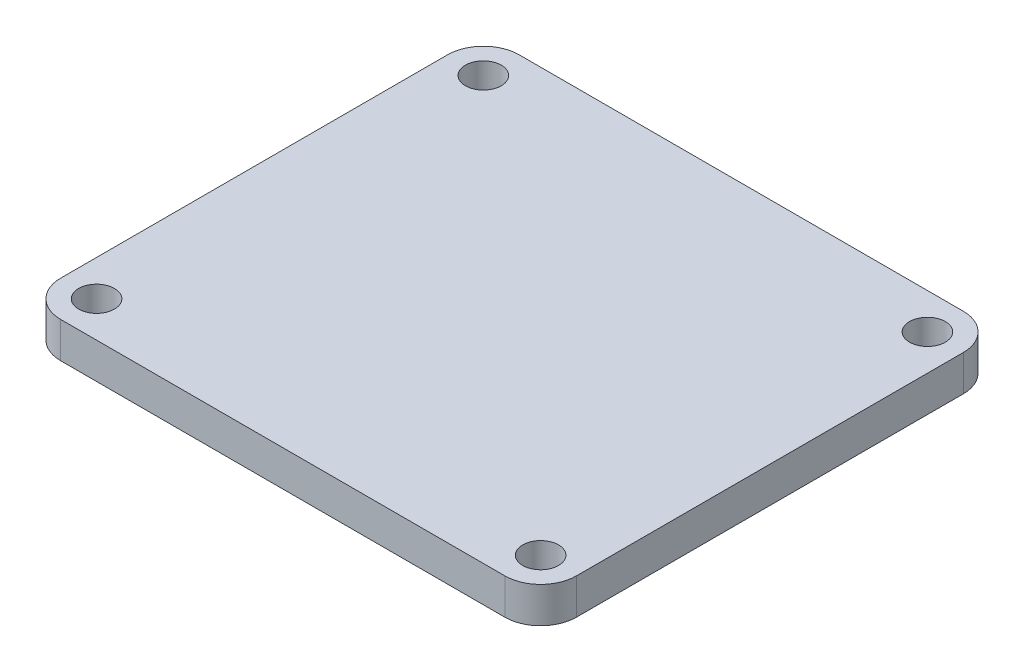
ISO-10303-21;
HEADER;
FILE_DESCRIPTION(('STEP AP214'),'2;1');
FILE_NAME('part.step','',(''),(''),'','','');
FILE_SCHEMA(('AUTOMOTIVE_DESIGN { 1 0 10303 214 1 1 1 1 }'));
ENDSEC;
DATA;
#1=APPLICATION_CONTEXT('core data for automotive mechanical design processes');
#2=APPLICATION_PROTOCOL_DEFINITION('international standard','automotive_design',2000,#1);
#3=PRODUCT_CONTEXT('',#1,'mechanical');
#4=PRODUCT('Part','Part','',(#3));
#5=PRODUCT_RELATED_PRODUCT_CATEGORY('part','',(#4));
#6=PRODUCT_DEFINITION_FORMATION('','',#4);
#7=PRODUCT_DEFINITION_CONTEXT('part definition',#1,'design');
#8=PRODUCT_DEFINITION('design','',#6,#7);
#9=PRODUCT_DEFINITION_SHAPE('','',#8);
#10=(LENGTH_UNIT() NAMED_UNIT(*) SI_UNIT(.MILLI.,.METRE.));
#11=(NAMED_UNIT(*) PLANE_ANGLE_UNIT() SI_UNIT($,.RADIAN.));
#12=(NAMED_UNIT(*) SI_UNIT($,.STERADIAN.) SOLID_ANGLE_UNIT());
#13=UNCERTAINTY_MEASURE_WITH_UNIT(LENGTH_MEASURE(1.E-05),#10,'distance_accuracy_value','');
#14=(GEOMETRIC_REPRESENTATION_CONTEXT(3) GLOBAL_UNCERTAINTY_ASSIGNED_CONTEXT((#13)) GLOBAL_UNIT_ASSIGNED_CONTEXT((#10,
#11,#12)) REPRESENTATION_CONTEXT('',''));
#15=CARTESIAN_POINT('',(0.,0.,0.));
#16=DIRECTION('',(0.,0.,1.));
#17=DIRECTION('',(1.,0.,0.));
#18=AXIS2_PLACEMENT_3D('',#15,#16,#17);
#19=CARTESIAN_POINT('',(-32.0842105263158,5.,0.));
#20=DIRECTION('',(1.,0.,0.));
#21=DIRECTION('',(0.,0.,-1.));
#22=AXIS2_PLACEMENT_3D('',#19,#20,#21);
#23=PLANE('',#22);
#24=DIRECTION('',(0.,0.,1.));
#25=VECTOR('',#24,1.);
#26=CARTESIAN_POINT('',(-32.0842105263158,0.,0.));
#27=LINE('',#26,#25);
#28=CARTESIAN_POINT('',(-32.0842105263158,0.,-12.5578947368421));
#29=VERTEX_POINT('',#28);
#30=CARTESIAN_POINT('',(-32.0842105263158,0.,41.4421052631579));
#31=VERTEX_POINT('',#30);
#32=EDGE_CURVE('E129',#29,#31,#27,.T.);
#33=ORIENTED_EDGE('',*,*,#32,.T.);
#34=DIRECTION('',(0.,-1.,0.));
#35=VECTOR('',#34,1.);
#36=CARTESIAN_POINT('',(-32.0842105263158,5.,41.4421052631579));
#37=LINE('',#36,#35);
#38=CARTESIAN_POINT('',(-32.0842105263158,5.,41.4421052631579));
#39=VERTEX_POINT('',#38);
#40=EDGE_CURVE('E106',#31,#39,#37,.F.);
#41=ORIENTED_EDGE('',*,*,#40,.T.);
#42=DIRECTION('',(0.,0.,1.));
#43=VECTOR('',#42,1.);
#44=CARTESIAN_POINT('',(-32.0842105263158,5.,0.));
#45=LINE('',#44,#43);
#46=CARTESIAN_POINT('',(-32.0842105263158,5.,-12.5578947368421));
#47=VERTEX_POINT('',#46);
#48=EDGE_CURVE('E242',#47,#39,#45,.T.);
#49=ORIENTED_EDGE('',*,*,#48,.F.);
#50=DIRECTION('',(0.,-1.,0.));
#51=VECTOR('',#50,1.);
#52=CARTESIAN_POINT('',(-32.0842105263158,0.,-12.5578947368421));
#53=LINE('',#52,#51);
#54=EDGE_CURVE('E111',#47,#29,#53,.T.);
#55=ORIENTED_EDGE('',*,*,#54,.T.);
#56=EDGE_LOOP('',(#33,#41,#49,#55));
#57=FACE_BOUND('',#56,.T.);
#58=ADVANCED_FACE('F35',(#57),#23,.F.);
#59=CARTESIAN_POINT('',(0.,5.,46.4421052631579));
#60=DIRECTION('',(0.,0.,-1.));
#61=DIRECTION('',(-1.,0.,0.));
#62=AXIS2_PLACEMENT_3D('',#59,#60,#61);
#63=PLANE('',#62);
#64=DIRECTION('',(1.,0.,0.));
#65=VECTOR('',#64,1.);
#66=CARTESIAN_POINT('',(0.,5.,46.4421052631579));
#67=LINE('',#66,#65);
#68=CARTESIAN_POINT('',(-27.0842105263158,5.,46.4421052631579));
#69=VERTEX_POINT('',#68);
#70=CARTESIAN_POINT('',(34.9157894736842,5.,46.4421052631579));
#71=VERTEX_POINT('',#70);
#72=EDGE_CURVE('E121',#69,#71,#67,.T.);
#73=ORIENTED_EDGE('',*,*,#72,.F.);
#74=DIRECTION('',(0.,-1.,0.));
#75=VECTOR('',#74,1.);
#76=CARTESIAN_POINT('',(-27.0842105263158,5.,46.4421052631579));
#77=LINE('',#76,#75);
#78=CARTESIAN_POINT('',(-27.0842105263158,0.,46.4421052631579));
#79=VERTEX_POINT('',#78);
#80=EDGE_CURVE('E105',#69,#79,#77,.T.);
#81=ORIENTED_EDGE('',*,*,#80,.T.);
#82=DIRECTION('',(1.,0.,0.));
#83=VECTOR('',#82,1.);
#84=CARTESIAN_POINT('',(0.,0.,46.4421052631579));
#85=LINE('',#84,#83);
#86=CARTESIAN_POINT('',(34.9157894736842,0.,46.4421052631579));
#87=VERTEX_POINT('',#86);
#88=EDGE_CURVE('E118',#79,#87,#85,.T.);
#89=ORIENTED_EDGE('',*,*,#88,.T.);
#90=DIRECTION('',(0.,-1.,0.));
#91=VECTOR('',#90,1.);
#92=CARTESIAN_POINT('',(34.9157894736842,5.,46.4421052631579));
#93=LINE('',#92,#91);
#94=EDGE_CURVE('E123',#87,#71,#93,.F.);
#95=ORIENTED_EDGE('',*,*,#94,.T.);
#96=EDGE_LOOP('',(#73,#81,#89,#95));
#97=FACE_BOUND('',#96,.T.);
#98=ADVANCED_FACE('F117',(#97),#63,.F.);
#99=CARTESIAN_POINT('',(39.9157894736842,5.,0.));
#100=DIRECTION('',(1.,0.,0.));
#101=DIRECTION('',(0.,0.,-1.));
#102=AXIS2_PLACEMENT_3D('',#99,#100,#101);
#103=PLANE('',#102);
#104=DIRECTION('',(0.,0.,1.));
#105=VECTOR('',#104,1.);
#106=CARTESIAN_POINT('',(39.9157894736842,5.,0.));
#107=LINE('',#106,#105);
#108=CARTESIAN_POINT('',(39.9157894736842,5.,-12.5578947368421));
#109=VERTEX_POINT('',#108);
#110=CARTESIAN_POINT('',(39.9157894736842,5.,41.4421052631579));
#111=VERTEX_POINT('',#110);
#112=EDGE_CURVE('E175',#109,#111,#107,.T.);
#113=ORIENTED_EDGE('',*,*,#112,.T.);
#114=DIRECTION('',(0.,-1.,0.));
#115=VECTOR('',#114,1.);
#116=CARTESIAN_POINT('',(39.9157894736842,0.,41.4421052631579));
#117=LINE('',#116,#115);
#118=CARTESIAN_POINT('',(39.9157894736842,0.,41.4421052631579));
#119=VERTEX_POINT('',#118);
#120=EDGE_CURVE('E167',#111,#119,#117,.T.);
#121=ORIENTED_EDGE('',*,*,#120,.T.);
#122=DIRECTION('',(0.,0.,1.));
#123=VECTOR('',#122,1.);
#124=CARTESIAN_POINT('',(39.9157894736842,0.,0.));
#125=LINE('',#124,#123);
#126=CARTESIAN_POINT('',(39.9157894736842,0.,-12.5578947368421));
#127=VERTEX_POINT('',#126);
#128=EDGE_CURVE('E128',#127,#119,#125,.T.);
#129=ORIENTED_EDGE('',*,*,#128,.F.);
#130=DIRECTION('',(0.,-1.,0.));
#131=VECTOR('',#130,1.);
#132=CARTESIAN_POINT('',(39.9157894736842,5.,-12.5578947368421));
#133=LINE('',#132,#131);
#134=EDGE_CURVE('E165',#127,#109,#133,.F.);
#135=ORIENTED_EDGE('',*,*,#134,.T.);
#136=EDGE_LOOP('',(#113,#121,#129,#135));
#137=FACE_BOUND('',#136,.T.);
#138=ADVANCED_FACE('F173',(#137),#103,.T.);
#139=CARTESIAN_POINT('',(34.9157894736842,5.,-12.5578947368421));
#140=DIRECTION('',(0.,-1.,0.));
#141=DIRECTION('',(0.,0.,-1.));
#142=AXIS2_PLACEMENT_3D('',#139,#140,#141);
#143=CYLINDRICAL_SURFACE('',#142,2.5);
#144=CARTESIAN_POINT('',(34.9157894736842,5.,-12.5578947368421));
#145=DIRECTION('',(0.,1.,0.));
#146=DIRECTION('',(0.,0.,1.));
#147=AXIS2_PLACEMENT_3D('',#144,#145,#146);
#148=CIRCLE('',#147,2.5);
#149=CARTESIAN_POINT('',(34.9157894736842,5.,-10.0578947368421));
#150=VERTEX_POINT('',#149);
#151=EDGE_CURVE('E187',#150,#150,#148,.T.);
#152=ORIENTED_EDGE('',*,*,#151,.T.);
#153=EDGE_LOOP('',(#152));
#154=FACE_BOUND('',#153,.T.);
#155=CARTESIAN_POINT('',(34.9157894736842,0.,-12.5578947368421));
#156=DIRECTION('',(0.,1.,0.));
#157=DIRECTION('',(0.,0.,1.));
#158=AXIS2_PLACEMENT_3D('',#155,#156,#157);
#159=CIRCLE('',#158,2.5);
#160=CARTESIAN_POINT('',(34.9157894736842,0.,-10.0578947368421));
#161=VERTEX_POINT('',#160);
#162=EDGE_CURVE('E142',#161,#161,#159,.T.);
#163=ORIENTED_EDGE('',*,*,#162,.F.);
#164=EDGE_LOOP('',(#163));
#165=FACE_BOUND('',#164,.T.);
#166=ADVANCED_FACE('F224',(#154,#165),#143,.F.);
#167=CARTESIAN_POINT('',(-27.0842105263158,5.,-12.5578947368421));
#168=DIRECTION('',(0.,-1.,0.));
#169=DIRECTION('',(0.,0.,-1.));
#170=AXIS2_PLACEMENT_3D('',#167,#168,#169);
#171=CYLINDRICAL_SURFACE('',#170,2.5);
#172=CARTESIAN_POINT('',(-27.0842105263158,5.,-12.5578947368421));
#173=DIRECTION('',(0.,1.,0.));
#174=DIRECTION('',(0.,0.,1.));
#175=AXIS2_PLACEMENT_3D('',#172,#173,#174);
#176=CIRCLE('',#175,2.5);
#177=CARTESIAN_POINT('',(-27.0842105263158,5.,-10.0578947368421));
#178=VERTEX_POINT('',#177);
#179=EDGE_CURVE('E184',#178,#178,#176,.F.);
#180=ORIENTED_EDGE('',*,*,#179,.F.);
#181=EDGE_LOOP('',(#180));
#182=FACE_BOUND('',#181,.T.);
#183=CARTESIAN_POINT('',(-27.0842105263158,0.,-12.5578947368421));
#184=DIRECTION('',(0.,1.,0.));
#185=DIRECTION('',(0.,0.,1.));
#186=AXIS2_PLACEMENT_3D('',#183,#184,#185);
#187=CIRCLE('',#186,2.5);
#188=CARTESIAN_POINT('',(-27.0842105263158,0.,-10.0578947368421));
#189=VERTEX_POINT('',#188);
#190=EDGE_CURVE('E139',#189,#189,#187,.F.);
#191=ORIENTED_EDGE('',*,*,#190,.T.);
#192=EDGE_LOOP('',(#191));
#193=FACE_BOUND('',#192,.T.);
#194=ADVANCED_FACE('F211',(#182,#193),#171,.F.);
#195=CARTESIAN_POINT('',(0.,5.,-17.5578947368421));
#196=DIRECTION('',(0.,0.,-1.));
#197=DIRECTION('',(-1.,0.,0.));
#198=AXIS2_PLACEMENT_3D('',#195,#196,#197);
#199=PLANE('',#198);
#200=DIRECTION('',(1.,0.,0.));
#201=VECTOR('',#200,1.);
#202=CARTESIAN_POINT('',(0.,5.,-17.5578947368421));
#203=LINE('',#202,#201);
#204=CARTESIAN_POINT('',(-27.0842105263158,5.,-17.5578947368421));
#205=VERTEX_POINT('',#204);
#206=CARTESIAN_POINT('',(34.9157894736842,5.,-17.5578947368421));
#207=VERTEX_POINT('',#206);
#208=EDGE_CURVE('E182',#205,#207,#203,.T.);
#209=ORIENTED_EDGE('',*,*,#208,.T.);
#210=DIRECTION('',(0.,-1.,0.));
#211=VECTOR('',#210,1.);
#212=CARTESIAN_POINT('',(34.9157894736842,5.,-17.5578947368421));
#213=LINE('',#212,#211);
#214=CARTESIAN_POINT('',(34.9157894736842,0.,-17.5578947368421));
#215=VERTEX_POINT('',#214);
#216=EDGE_CURVE('E11',#207,#215,#213,.T.);
#217=ORIENTED_EDGE('',*,*,#216,.T.);
#218=DIRECTION('',(1.,0.,0.));
#219=VECTOR('',#218,1.);
#220=CARTESIAN_POINT('',(0.,0.,-17.5578947368421));
#221=LINE('',#220,#219);
#222=CARTESIAN_POINT('',(-27.0842105263158,0.,-17.5578947368421));
#223=VERTEX_POINT('',#222);
#224=EDGE_CURVE('E131',#223,#215,#221,.T.);
#225=ORIENTED_EDGE('',*,*,#224,.F.);
#226=DIRECTION('',(0.,-1.,0.));
#227=VECTOR('',#226,1.);
#228=CARTESIAN_POINT('',(-27.0842105263158,5.,-17.5578947368421));
#229=LINE('',#228,#227);
#230=EDGE_CURVE('E43',#223,#205,#229,.F.);
#231=ORIENTED_EDGE('',*,*,#230,.T.);
#232=EDGE_LOOP('',(#209,#217,#225,#231));
#233=FACE_BOUND('',#232,.T.);
#234=ADVANCED_FACE('F181',(#233),#199,.T.);
#235=CARTESIAN_POINT('',(-27.0842105263158,5.,41.4421052631579));
#236=DIRECTION('',(0.,-1.,0.));
#237=DIRECTION('',(0.,0.,-1.));
#238=AXIS2_PLACEMENT_3D('',#235,#236,#237);
#239=CYLINDRICAL_SURFACE('',#238,2.5);
#240=CARTESIAN_POINT('',(-27.0842105263158,5.,41.4421052631579));
#241=DIRECTION('',(0.,1.,0.));
#242=DIRECTION('',(0.,0.,1.));
#243=AXIS2_PLACEMENT_3D('',#240,#241,#242);
#244=CIRCLE('',#243,2.5);
#245=CARTESIAN_POINT('',(-27.0842105263158,5.,43.9421052631579));
#246=VERTEX_POINT('',#245);
#247=EDGE_CURVE('E148',#246,#246,#244,.T.);
#248=ORIENTED_EDGE('',*,*,#247,.T.);
#249=EDGE_LOOP('',(#248));
#250=FACE_BOUND('',#249,.T.);
#251=CARTESIAN_POINT('',(-27.0842105263158,0.,41.4421052631579));
#252=DIRECTION('',(0.,1.,0.));
#253=DIRECTION('',(0.,0.,1.));
#254=AXIS2_PLACEMENT_3D('',#251,#252,#253);
#255=CIRCLE('',#254,2.5);
#256=CARTESIAN_POINT('',(-27.0842105263158,0.,43.9421052631579));
#257=VERTEX_POINT('',#256);
#258=EDGE_CURVE('E133',#257,#257,#255,.T.);
#259=ORIENTED_EDGE('',*,*,#258,.F.);
#260=EDGE_LOOP('',(#259));
#261=FACE_BOUND('',#260,.T.);
#262=ADVANCED_FACE('F199',(#250,#261),#239,.F.);
#263=CARTESIAN_POINT('',(34.9157894736842,5.,41.4421052631579));
#264=DIRECTION('',(0.,-1.,0.));
#265=DIRECTION('',(0.,0.,-1.));
#266=AXIS2_PLACEMENT_3D('',#263,#264,#265);
#267=CYLINDRICAL_SURFACE('',#266,2.5);
#268=CARTESIAN_POINT('',(34.9157894736842,5.,41.4421052631579));
#269=DIRECTION('',(0.,1.,0.));
#270=DIRECTION('',(0.,0.,1.));
#271=AXIS2_PLACEMENT_3D('',#268,#269,#270);
#272=CIRCLE('',#271,2.5);
#273=CARTESIAN_POINT('',(34.9157894736842,5.,43.9421052631579));
#274=VERTEX_POINT('',#273);
#275=EDGE_CURVE('E149',#274,#274,#272,.F.);
#276=ORIENTED_EDGE('',*,*,#275,.F.);
#277=EDGE_LOOP('',(#276));
#278=FACE_BOUND('',#277,.T.);
#279=CARTESIAN_POINT('',(34.9157894736842,0.,41.4421052631579));
#280=DIRECTION('',(0.,1.,0.));
#281=DIRECTION('',(0.,0.,1.));
#282=AXIS2_PLACEMENT_3D('',#279,#280,#281);
#283=CIRCLE('',#282,2.5);
#284=CARTESIAN_POINT('',(34.9157894736842,0.,43.9421052631579));
#285=VERTEX_POINT('',#284);
#286=EDGE_CURVE('E145',#285,#285,#283,.F.);
#287=ORIENTED_EDGE('',*,*,#286,.T.);
#288=EDGE_LOOP('',(#287));
#289=FACE_BOUND('',#288,.T.);
#290=ADVANCED_FACE('F201',(#278,#289),#267,.F.);
#291=CARTESIAN_POINT('',(0.,5.,0.));
#292=DIRECTION('',(0.,1.,0.));
#293=DIRECTION('',(0.,0.,1.));
#294=AXIS2_PLACEMENT_3D('',#291,#292,#293);
#295=PLANE('',#294);
#296=ORIENTED_EDGE('',*,*,#247,.F.);
#297=EDGE_LOOP('',(#296));
#298=FACE_BOUND('',#297,.T.);
#299=ORIENTED_EDGE('',*,*,#48,.T.);
#300=CARTESIAN_POINT('',(-27.0842105263158,5.,41.4421052631579));
#301=DIRECTION('',(0.,1.,0.));
#302=DIRECTION('',(0.,0.,1.));
#303=AXIS2_PLACEMENT_3D('',#300,#301,#302);
#304=CIRCLE('',#303,5.);
#305=EDGE_CURVE('E163',#39,#69,#304,.T.);
#306=ORIENTED_EDGE('',*,*,#305,.T.);
#307=ORIENTED_EDGE('',*,*,#72,.T.);
#308=CARTESIAN_POINT('',(34.9157894736842,5.,41.4421052631579));
#309=DIRECTION('',(0.,1.,0.));
#310=DIRECTION('',(0.,0.,1.));
#311=AXIS2_PLACEMENT_3D('',#308,#309,#310);
#312=CIRCLE('',#311,5.);
#313=EDGE_CURVE('E161',#71,#111,#312,.T.);
#314=ORIENTED_EDGE('',*,*,#313,.T.);
#315=ORIENTED_EDGE('',*,*,#112,.F.);
#316=CARTESIAN_POINT('',(34.9157894736842,5.,-12.5578947368421));
#317=DIRECTION('',(0.,1.,0.));
#318=DIRECTION('',(0.,0.,1.));
#319=AXIS2_PLACEMENT_3D('',#316,#317,#318);
#320=CIRCLE('',#319,5.);
#321=EDGE_CURVE('E50',#109,#207,#320,.T.);
#322=ORIENTED_EDGE('',*,*,#321,.T.);
#323=ORIENTED_EDGE('',*,*,#208,.F.);
#324=CARTESIAN_POINT('',(-27.0842105263158,5.,-12.5578947368421));
#325=DIRECTION('',(0.,1.,0.));
#326=DIRECTION('',(0.,0.,1.));
#327=AXIS2_PLACEMENT_3D('',#324,#325,#326);
#328=CIRCLE('',#327,5.);
#329=EDGE_CURVE('E158',#205,#47,#328,.T.);
#330=ORIENTED_EDGE('',*,*,#329,.T.);
#331=EDGE_LOOP('',(#299,#306,#307,#314,#315,#322,#323,#330));
#332=FACE_BOUND('',#331,.T.);
#333=ORIENTED_EDGE('',*,*,#179,.T.);
#334=EDGE_LOOP('',(#333));
#335=FACE_BOUND('',#334,.T.);
#336=ORIENTED_EDGE('',*,*,#151,.F.);
#337=EDGE_LOOP('',(#336));
#338=FACE_BOUND('',#337,.T.);
#339=ORIENTED_EDGE('',*,*,#275,.T.);
#340=EDGE_LOOP('',(#339));
#341=FACE_BOUND('',#340,.T.);
#342=ADVANCED_FACE('F208',(#298,#332,#335,#338,#341),#295,.T.);
#343=CARTESIAN_POINT('',(0.,0.,0.));
#344=DIRECTION('',(0.,1.,0.));
#345=DIRECTION('',(0.,0.,1.));
#346=AXIS2_PLACEMENT_3D('',#343,#344,#345);
#347=PLANE('',#346);
#348=ORIENTED_EDGE('',*,*,#258,.T.);
#349=EDGE_LOOP('',(#348));
#350=FACE_BOUND('',#349,.T.);
#351=ORIENTED_EDGE('',*,*,#88,.F.);
#352=CARTESIAN_POINT('',(-27.0842105263158,0.,41.4421052631579));
#353=DIRECTION('',(0.,1.,0.));
#354=DIRECTION('',(0.,0.,1.));
#355=AXIS2_PLACEMENT_3D('',#352,#353,#354);
#356=CIRCLE('',#355,5.);
#357=EDGE_CURVE('E101',#79,#31,#356,.F.);
#358=ORIENTED_EDGE('',*,*,#357,.T.);
#359=ORIENTED_EDGE('',*,*,#32,.F.);
#360=CARTESIAN_POINT('',(-27.0842105263158,0.,-12.5578947368421));
#361=DIRECTION('',(0.,1.,0.));
#362=DIRECTION('',(0.,0.,1.));
#363=AXIS2_PLACEMENT_3D('',#360,#361,#362);
#364=CIRCLE('',#363,5.);
#365=EDGE_CURVE('E122',#29,#223,#364,.F.);
#366=ORIENTED_EDGE('',*,*,#365,.T.);
#367=ORIENTED_EDGE('',*,*,#224,.T.);
#368=CARTESIAN_POINT('',(34.9157894736842,0.,-12.5578947368421));
#369=DIRECTION('',(0.,1.,0.));
#370=DIRECTION('',(0.,0.,1.));
#371=AXIS2_PLACEMENT_3D('',#368,#369,#370);
#372=CIRCLE('',#371,5.);
#373=EDGE_CURVE('E152',#215,#127,#372,.F.);
#374=ORIENTED_EDGE('',*,*,#373,.T.);
#375=ORIENTED_EDGE('',*,*,#128,.T.);
#376=CARTESIAN_POINT('',(34.9157894736842,0.,41.4421052631579));
#377=DIRECTION('',(0.,1.,0.));
#378=DIRECTION('',(0.,0.,1.));
#379=AXIS2_PLACEMENT_3D('',#376,#377,#378);
#380=CIRCLE('',#379,5.);
#381=EDGE_CURVE('E112',#119,#87,#380,.F.);
#382=ORIENTED_EDGE('',*,*,#381,.T.);
#383=EDGE_LOOP('',(#351,#358,#359,#366,#367,#374,#375,#382));
#384=FACE_BOUND('',#383,.T.);
#385=ORIENTED_EDGE('',*,*,#190,.F.);
#386=EDGE_LOOP('',(#385));
#387=FACE_BOUND('',#386,.T.);
#388=ORIENTED_EDGE('',*,*,#162,.T.);
#389=EDGE_LOOP('',(#388));
#390=FACE_BOUND('',#389,.T.);
#391=ORIENTED_EDGE('',*,*,#286,.F.);
#392=EDGE_LOOP('',(#391));
#393=FACE_BOUND('',#392,.T.);
#394=ADVANCED_FACE('F125',(#350,#384,#387,#390,#393),#347,.F.);
#395=CARTESIAN_POINT('',(-27.0842105263158,5.,41.4421052631579));
#396=DIRECTION('',(0.,-1.,0.));
#397=DIRECTION('',(0.,0.,-1.));
#398=AXIS2_PLACEMENT_3D('',#395,#396,#397);
#399=CYLINDRICAL_SURFACE('',#398,5.);
#400=ORIENTED_EDGE('',*,*,#305,.F.);
#401=ORIENTED_EDGE('',*,*,#40,.F.);
#402=ORIENTED_EDGE('',*,*,#357,.F.);
#403=ORIENTED_EDGE('',*,*,#80,.F.);
#404=EDGE_LOOP('',(#400,#401,#402,#403));
#405=FACE_BOUND('',#404,.T.);
#406=ADVANCED_FACE('F104',(#405),#399,.T.);
#407=CARTESIAN_POINT('',(34.9157894736842,5.,41.4421052631579));
#408=DIRECTION('',(0.,1.,0.));
#409=DIRECTION('',(0.,0.,1.));
#410=AXIS2_PLACEMENT_3D('',#407,#408,#409);
#411=CYLINDRICAL_SURFACE('',#410,5.);
#412=ORIENTED_EDGE('',*,*,#313,.F.);
#413=ORIENTED_EDGE('',*,*,#94,.F.);
#414=ORIENTED_EDGE('',*,*,#381,.F.);
#415=ORIENTED_EDGE('',*,*,#120,.F.);
#416=EDGE_LOOP('',(#412,#413,#414,#415));
#417=FACE_BOUND('',#416,.T.);
#418=ADVANCED_FACE('F259',(#417),#411,.T.);
#419=CARTESIAN_POINT('',(34.9157894736842,5.,-12.5578947368421));
#420=DIRECTION('',(0.,-1.,0.));
#421=DIRECTION('',(0.,0.,-1.));
#422=AXIS2_PLACEMENT_3D('',#419,#420,#421);
#423=CYLINDRICAL_SURFACE('',#422,5.);
#424=ORIENTED_EDGE('',*,*,#321,.F.);
#425=ORIENTED_EDGE('',*,*,#134,.F.);
#426=ORIENTED_EDGE('',*,*,#373,.F.);
#427=ORIENTED_EDGE('',*,*,#216,.F.);
#428=EDGE_LOOP('',(#424,#425,#426,#427));
#429=FACE_BOUND('',#428,.T.);
#430=ADVANCED_FACE('F180',(#429),#423,.T.);
#431=CARTESIAN_POINT('',(-27.0842105263158,5.,-12.5578947368421));
#432=DIRECTION('',(0.,1.,0.));
#433=DIRECTION('',(0.,0.,1.));
#434=AXIS2_PLACEMENT_3D('',#431,#432,#433);
#435=CYLINDRICAL_SURFACE('',#434,5.);
#436=ORIENTED_EDGE('',*,*,#329,.F.);
#437=ORIENTED_EDGE('',*,*,#230,.F.);
#438=ORIENTED_EDGE('',*,*,#365,.F.);
#439=ORIENTED_EDGE('',*,*,#54,.F.);
#440=EDGE_LOOP('',(#436,#437,#438,#439));
#441=FACE_BOUND('',#440,.T.);
#442=ADVANCED_FACE('F37',(#441),#435,.T.);
#443=CLOSED_SHELL('',(#58,#98,#138,#166,#194,#234,#262,#290,#342,#394,#406,#418,#430,#442));
#444=MANIFOLD_SOLID_BREP('B2',#443);
#445=ADVANCED_BREP_SHAPE_REPRESENTATION('',(#18,#444),#14);
#446=SHAPE_DEFINITION_REPRESENTATION(#9,#445);
ENDSEC;
END-ISO-10303-21;
